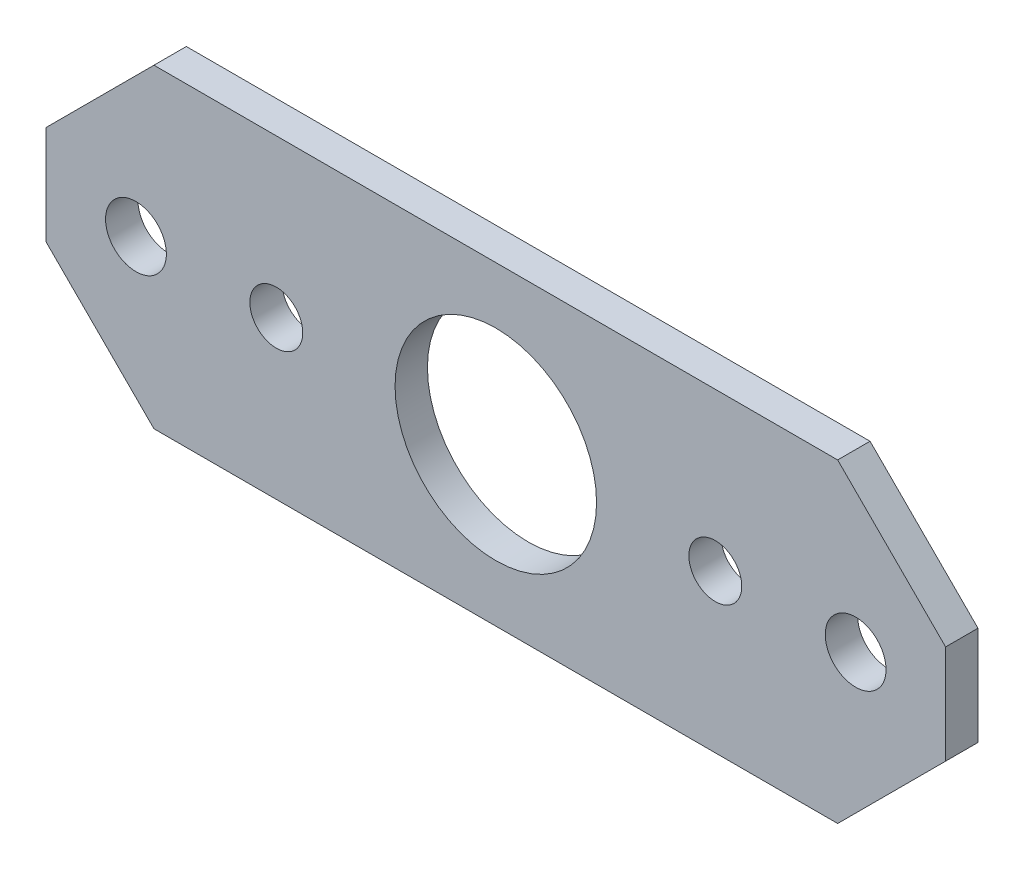
ISO-10303-21;
HEADER;
FILE_DESCRIPTION(('STEP AP214'),'2;1');
FILE_NAME('part.step','',(''),(''),'','','');
FILE_SCHEMA(('AUTOMOTIVE_DESIGN { 1 0 10303 214 1 1 1 1 }'));
ENDSEC;
DATA;
#1=APPLICATION_CONTEXT('core data for automotive mechanical design processes');
#2=APPLICATION_PROTOCOL_DEFINITION('international standard','automotive_design',2000,#1);
#3=PRODUCT_CONTEXT('',#1,'mechanical');
#4=PRODUCT('Part','Part','',(#3));
#5=PRODUCT_RELATED_PRODUCT_CATEGORY('part','',(#4));
#6=PRODUCT_DEFINITION_FORMATION('','',#4);
#7=PRODUCT_DEFINITION_CONTEXT('part definition',#1,'design');
#8=PRODUCT_DEFINITION('design','',#6,#7);
#9=PRODUCT_DEFINITION_SHAPE('','',#8);
#10=(LENGTH_UNIT() NAMED_UNIT(*) SI_UNIT(.MILLI.,.METRE.));
#11=(NAMED_UNIT(*) PLANE_ANGLE_UNIT() SI_UNIT($,.RADIAN.));
#12=(NAMED_UNIT(*) SI_UNIT($,.STERADIAN.) SOLID_ANGLE_UNIT());
#13=UNCERTAINTY_MEASURE_WITH_UNIT(LENGTH_MEASURE(1.E-05),#10,'distance_accuracy_value','');
#14=(GEOMETRIC_REPRESENTATION_CONTEXT(3) GLOBAL_UNCERTAINTY_ASSIGNED_CONTEXT((#13)) GLOBAL_UNIT_ASSIGNED_CONTEXT((#10,
#11,#12)) REPRESENTATION_CONTEXT('',''));
#15=CARTESIAN_POINT('',(0.,0.,0.));
#16=DIRECTION('',(0.,0.,1.));
#17=DIRECTION('',(1.,0.,0.));
#18=AXIS2_PLACEMENT_3D('',#15,#16,#17);
#19=CARTESIAN_POINT('',(-31.75,-11.1125,2.286));
#20=DIRECTION('',(0.,0.,1.));
#21=DIRECTION('',(1.,0.,0.));
#22=AXIS2_PLACEMENT_3D('',#19,#20,#21);
#23=PLANE('',#22);
#24=CARTESIAN_POINT('',(0.,0.,2.286));
#25=DIRECTION('',(0.,0.,-1.));
#26=DIRECTION('',(-1.,0.,0.));
#27=AXIS2_PLACEMENT_3D('',#24,#25,#26);
#28=CIRCLE('',#27,7.112);
#29=CARTESIAN_POINT('',(-7.112,0.,2.286));
#30=VERTEX_POINT('',#29);
#31=EDGE_CURVE('E116',#30,#30,#28,.T.);
#32=ORIENTED_EDGE('',*,*,#31,.T.);
#33=EDGE_LOOP('',(#32));
#34=FACE_BOUND('',#33,.T.);
#35=CARTESIAN_POINT('',(25.4,0.,2.286));
#36=DIRECTION('',(0.,0.,-1.));
#37=DIRECTION('',(-1.,0.,0.));
#38=AXIS2_PLACEMENT_3D('',#35,#36,#37);
#39=CIRCLE('',#38,2.1463);
#40=CARTESIAN_POINT('',(23.2537,0.,2.286));
#41=VERTEX_POINT('',#40);
#42=EDGE_CURVE('E119',#41,#41,#39,.T.);
#43=ORIENTED_EDGE('',*,*,#42,.T.);
#44=EDGE_LOOP('',(#43));
#45=FACE_BOUND('',#44,.T.);
#46=CARTESIAN_POINT('',(-25.4,0.,2.286));
#47=DIRECTION('',(0.,0.,-1.));
#48=DIRECTION('',(-1.,0.,0.));
#49=AXIS2_PLACEMENT_3D('',#46,#47,#48);
#50=CIRCLE('',#49,2.1463);
#51=CARTESIAN_POINT('',(-27.5463,0.,2.286));
#52=VERTEX_POINT('',#51);
#53=EDGE_CURVE('E122',#52,#52,#50,.T.);
#54=ORIENTED_EDGE('',*,*,#53,.T.);
#55=EDGE_LOOP('',(#54));
#56=FACE_BOUND('',#55,.T.);
#57=CARTESIAN_POINT('',(15.494,0.,2.286));
#58=DIRECTION('',(0.,0.,-1.));
#59=DIRECTION('',(-1.,0.,0.));
#60=AXIS2_PLACEMENT_3D('',#57,#58,#59);
#61=CIRCLE('',#60,1.8669);
#62=CARTESIAN_POINT('',(13.6271,0.,2.286));
#63=VERTEX_POINT('',#62);
#64=EDGE_CURVE('E124',#63,#63,#61,.T.);
#65=ORIENTED_EDGE('',*,*,#64,.T.);
#66=EDGE_LOOP('',(#65));
#67=FACE_BOUND('',#66,.T.);
#68=CARTESIAN_POINT('',(-15.494,0.,2.286));
#69=DIRECTION('',(0.,0.,-1.));
#70=DIRECTION('',(-1.,0.,0.));
#71=AXIS2_PLACEMENT_3D('',#68,#69,#70);
#72=CIRCLE('',#71,1.8669);
#73=CARTESIAN_POINT('',(-17.3609,0.,2.286));
#74=VERTEX_POINT('',#73);
#75=EDGE_CURVE('E20',#74,#74,#72,.T.);
#76=ORIENTED_EDGE('',*,*,#75,.T.);
#77=EDGE_LOOP('',(#76));
#78=FACE_BOUND('',#77,.T.);
#79=DIRECTION('',(1.,0.,0.));
#80=VECTOR('',#79,1.);
#81=CARTESIAN_POINT('',(-31.75,11.1125,2.286));
#82=LINE('',#81,#80);
#83=CARTESIAN_POINT('',(24.1300000006,11.1124999998,2.286));
#84=VERTEX_POINT('',#83);
#85=CARTESIAN_POINT('',(-24.1300000007,11.1124999999,2.286));
#86=VERTEX_POINT('',#85);
#87=EDGE_CURVE('E153',#84,#86,#82,.F.);
#88=ORIENTED_EDGE('',*,*,#87,.T.);
#89=DIRECTION('',(0.707106781186548,0.707106781186548,0.));
#90=VECTOR('',#89,1.);
#91=CARTESIAN_POINT('',(-31.75,3.4925,2.286));
#92=LINE('',#91,#90);
#93=CARTESIAN_POINT('',(-31.749999999795,3.492500000615,2.286));
#94=VERTEX_POINT('',#93);
#95=EDGE_CURVE('E148',#86,#94,#92,.F.);
#96=ORIENTED_EDGE('',*,*,#95,.T.);
#97=DIRECTION('',(0.,1.,0.));
#98=VECTOR('',#97,1.);
#99=CARTESIAN_POINT('',(-31.75,11.1125,2.286));
#100=LINE('',#99,#98);
#101=CARTESIAN_POINT('',(-31.7499999999438,-3.49250000039375,2.286));
#102=VERTEX_POINT('',#101);
#103=EDGE_CURVE('E143',#94,#102,#100,.F.);
#104=ORIENTED_EDGE('',*,*,#103,.T.);
#105=DIRECTION('',(-0.707106781186548,0.707106781186548,0.));
#106=VECTOR('',#105,1.);
#107=CARTESIAN_POINT('',(-24.13,-11.1125,2.286));
#108=LINE('',#107,#106);
#109=CARTESIAN_POINT('',(-24.1300000006,-11.1124999998,2.286));
#110=VERTEX_POINT('',#109);
#111=EDGE_CURVE('E138',#102,#110,#108,.F.);
#112=ORIENTED_EDGE('',*,*,#111,.T.);
#113=DIRECTION('',(1.,0.,0.));
#114=VECTOR('',#113,1.);
#115=CARTESIAN_POINT('',(-31.75,-11.1125,2.286));
#116=LINE('',#115,#114);
#117=CARTESIAN_POINT('',(24.1300000006,-11.1124999998,2.286));
#118=VERTEX_POINT('',#117);
#119=EDGE_CURVE('E84',#110,#118,#116,.T.);
#120=ORIENTED_EDGE('',*,*,#119,.T.);
#121=DIRECTION('',(-0.707106781186548,-0.707106781186548,0.));
#122=VECTOR('',#121,1.);
#123=CARTESIAN_POINT('',(31.75,-3.4925,2.286));
#124=LINE('',#123,#122);
#125=CARTESIAN_POINT('',(31.7499999998875,-3.4925000003375,2.286));
#126=VERTEX_POINT('',#125);
#127=EDGE_CURVE('E83',#118,#126,#124,.F.);
#128=ORIENTED_EDGE('',*,*,#127,.T.);
#129=DIRECTION('',(0.,1.,0.));
#130=VECTOR('',#129,1.);
#131=CARTESIAN_POINT('',(31.75,11.1125,2.286));
#132=LINE('',#131,#130);
#133=CARTESIAN_POINT('',(31.7499999998975,3.4925000007175,2.286));
#134=VERTEX_POINT('',#133);
#135=EDGE_CURVE('E80',#126,#134,#132,.T.);
#136=ORIENTED_EDGE('',*,*,#135,.T.);
#137=DIRECTION('',(0.707106781186548,-0.707106781186548,0.));
#138=VECTOR('',#137,1.);
#139=CARTESIAN_POINT('',(24.13,11.1125,2.286));
#140=LINE('',#139,#138);
#141=EDGE_CURVE('E158',#134,#84,#140,.F.);
#142=ORIENTED_EDGE('',*,*,#141,.T.);
#143=EDGE_LOOP('',(#88,#96,#104,#112,#120,#128,#136,#142));
#144=FACE_BOUND('',#143,.T.);
#145=ADVANCED_FACE('F17',(#34,#45,#56,#67,#78,#144),#23,.T.);
#146=CARTESIAN_POINT('',(31.75,-3.4925,2.286));
#147=DIRECTION('',(-0.707106781186548,0.707106781186548,0.));
#148=DIRECTION('',(-0.707106781186548,-0.707106781186548,0.));
#149=AXIS2_PLACEMENT_3D('',#146,#147,#148);
#150=PLANE('',#149);
#151=DIRECTION('',(0.,0.,1.));
#152=VECTOR('',#151,1.);
#153=CARTESIAN_POINT('',(24.1300000008,-11.1125,2.286));
#154=LINE('',#153,#152);
#155=CARTESIAN_POINT('',(24.1300000006,-11.1124999998,-2.34694100091637E-10));
#156=VERTEX_POINT('',#155);
#157=EDGE_CURVE('E132',#118,#156,#154,.F.);
#158=ORIENTED_EDGE('',*,*,#157,.T.);
#159=DIRECTION('',(0.707106781170308,0.707106781202787,0.));
#160=VECTOR('',#159,1.);
#161=CARTESIAN_POINT('',(24.1300000008,-11.1125,0.));
#162=LINE('',#161,#160);
#163=CARTESIAN_POINT('',(31.7499999998875,-3.4925000003375,-2.34693883251202E-10));
#164=VERTEX_POINT('',#163);
#165=EDGE_CURVE('E100',#156,#164,#162,.T.);
#166=ORIENTED_EDGE('',*,*,#165,.T.);
#167=DIRECTION('',(0.,0.,1.));
#168=VECTOR('',#167,1.);
#169=CARTESIAN_POINT('',(31.75,-3.49250000045,2.286));
#170=LINE('',#169,#168);
#171=EDGE_CURVE('E89',#164,#126,#170,.T.);
#172=ORIENTED_EDGE('',*,*,#171,.T.);
#173=ORIENTED_EDGE('',*,*,#127,.F.);
#174=EDGE_LOOP('',(#158,#166,#172,#173));
#175=FACE_BOUND('',#174,.T.);
#176=ADVANCED_FACE('F99',(#175),#150,.F.);
#177=CARTESIAN_POINT('',(31.75,11.1125,2.286));
#178=DIRECTION('',(-1.,0.,0.));
#179=DIRECTION('',(0.,0.,1.));
#180=AXIS2_PLACEMENT_3D('',#177,#178,#179);
#181=PLANE('',#180);
#182=ORIENTED_EDGE('',*,*,#171,.F.);
#183=DIRECTION('',(0.,1.,0.));
#184=VECTOR('',#183,1.);
#185=CARTESIAN_POINT('',(31.75,-11.1125,0.));
#186=LINE('',#185,#184);
#187=CARTESIAN_POINT('',(31.7499999998975,3.4925000007175,-2.34693774830985E-10));
#188=VERTEX_POINT('',#187);
#189=EDGE_CURVE('E172',#164,#188,#186,.T.);
#190=ORIENTED_EDGE('',*,*,#189,.T.);
#191=DIRECTION('',(0.,0.,1.));
#192=VECTOR('',#191,1.);
#193=CARTESIAN_POINT('',(31.74999999959,3.49250000041,2.286));
#194=LINE('',#193,#192);
#195=EDGE_CURVE('E96',#188,#134,#194,.T.);
#196=ORIENTED_EDGE('',*,*,#195,.T.);
#197=ORIENTED_EDGE('',*,*,#135,.F.);
#198=EDGE_LOOP('',(#182,#190,#196,#197));
#199=FACE_BOUND('',#198,.T.);
#200=ADVANCED_FACE('F93',(#199),#181,.F.);
#201=CARTESIAN_POINT('',(24.13,11.1125,2.286));
#202=DIRECTION('',(-0.707106781186548,-0.707106781186548,0.));
#203=DIRECTION('',(0.707106781186548,-0.707106781186548,0.));
#204=AXIS2_PLACEMENT_3D('',#201,#202,#203);
#205=PLANE('',#204);
#206=ORIENTED_EDGE('',*,*,#195,.F.);
#207=DIRECTION('',(-0.707106781187475,0.707106781185619,0.));
#208=VECTOR('',#207,1.);
#209=CARTESIAN_POINT('',(31.75,3.49250000082,0.));
#210=LINE('',#209,#208);
#211=CARTESIAN_POINT('',(24.1300000006,11.1124999998,-2.34693883251202E-10));
#212=VERTEX_POINT('',#211);
#213=EDGE_CURVE('E169',#188,#212,#210,.T.);
#214=ORIENTED_EDGE('',*,*,#213,.T.);
#215=DIRECTION('',(0.,0.,-1.));
#216=VECTOR('',#215,1.);
#217=CARTESIAN_POINT('',(24.1300000008,11.1125,2.286));
#218=LINE('',#217,#216);
#219=EDGE_CURVE('E155',#212,#84,#218,.F.);
#220=ORIENTED_EDGE('',*,*,#219,.T.);
#221=ORIENTED_EDGE('',*,*,#141,.F.);
#222=EDGE_LOOP('',(#206,#214,#220,#221));
#223=FACE_BOUND('',#222,.T.);
#224=ADVANCED_FACE('F167',(#223),#205,.F.);
#225=CARTESIAN_POINT('',(-31.75,11.1125,2.286));
#226=DIRECTION('',(0.,-1.,0.));
#227=DIRECTION('',(0.,0.,-1.));
#228=AXIS2_PLACEMENT_3D('',#225,#226,#227);
#229=PLANE('',#228);
#230=ORIENTED_EDGE('',*,*,#219,.F.);
#231=DIRECTION('',(1.,0.,0.));
#232=VECTOR('',#231,1.);
#233=CARTESIAN_POINT('',(-31.75,11.1125,0.));
#234=LINE('',#233,#232);
#235=CARTESIAN_POINT('',(-24.1300000007,11.1124999999,-2.34693774830985E-10));
#236=VERTEX_POINT('',#235);
#237=EDGE_CURVE('E171',#212,#236,#234,.F.);
#238=ORIENTED_EDGE('',*,*,#237,.T.);
#239=DIRECTION('',(0.,0.,1.));
#240=VECTOR('',#239,1.);
#241=CARTESIAN_POINT('',(-24.1300000004,11.1124999996,2.286));
#242=LINE('',#241,#240);
#243=EDGE_CURVE('E150',#236,#86,#242,.T.);
#244=ORIENTED_EDGE('',*,*,#243,.T.);
#245=ORIENTED_EDGE('',*,*,#87,.F.);
#246=EDGE_LOOP('',(#230,#238,#244,#245));
#247=FACE_BOUND('',#246,.T.);
#248=ADVANCED_FACE('F163',(#247),#229,.F.);
#249=CARTESIAN_POINT('',(-31.75,3.4925,2.286));
#250=DIRECTION('',(0.707106781186548,-0.707106781186548,0.));
#251=DIRECTION('',(0.707106781186548,0.707106781186548,0.));
#252=AXIS2_PLACEMENT_3D('',#249,#250,#251);
#253=PLANE('',#252);
#254=ORIENTED_EDGE('',*,*,#243,.F.);
#255=DIRECTION('',(-0.707106781187475,-0.70710678118562,0.));
#256=VECTOR('',#255,1.);
#257=CARTESIAN_POINT('',(-24.1300000008,11.1125,0.));
#258=LINE('',#257,#256);
#259=CARTESIAN_POINT('',(-31.749999999795,3.492500000615,-2.34693883251202E-10));
#260=VERTEX_POINT('',#259);
#261=EDGE_CURVE('E174',#236,#260,#258,.T.);
#262=ORIENTED_EDGE('',*,*,#261,.T.);
#263=DIRECTION('',(0.,0.,-1.));
#264=VECTOR('',#263,1.);
#265=CARTESIAN_POINT('',(-31.75,3.49250000082,2.286));
#266=LINE('',#265,#264);
#267=EDGE_CURVE('E145',#260,#94,#266,.F.);
#268=ORIENTED_EDGE('',*,*,#267,.T.);
#269=ORIENTED_EDGE('',*,*,#95,.F.);
#270=EDGE_LOOP('',(#254,#262,#268,#269));
#271=FACE_BOUND('',#270,.T.);
#272=ADVANCED_FACE('F197',(#271),#253,.F.);
#273=CARTESIAN_POINT('',(-31.75,11.1125,2.286));
#274=DIRECTION('',(1.,0.,0.));
#275=DIRECTION('',(0.,0.,-1.));
#276=AXIS2_PLACEMENT_3D('',#273,#274,#275);
#277=PLANE('',#276);
#278=DIRECTION('',(0.,0.,1.));
#279=VECTOR('',#278,1.);
#280=CARTESIAN_POINT('',(-31.749999999775,-3.492500000225,2.286));
#281=LINE('',#280,#279);
#282=CARTESIAN_POINT('',(-31.7499999999438,-3.49250000039375,-2.34693774830985E-10));
#283=VERTEX_POINT('',#282);
#284=EDGE_CURVE('E140',#283,#102,#281,.T.);
#285=ORIENTED_EDGE('',*,*,#284,.T.);
#286=ORIENTED_EDGE('',*,*,#103,.F.);
#287=ORIENTED_EDGE('',*,*,#267,.F.);
#288=DIRECTION('',(0.,1.,0.));
#289=VECTOR('',#288,1.);
#290=CARTESIAN_POINT('',(-31.75,-11.1125,0.));
#291=LINE('',#290,#289);
#292=EDGE_CURVE('E179',#260,#283,#291,.F.);
#293=ORIENTED_EDGE('',*,*,#292,.T.);
#294=EDGE_LOOP('',(#285,#286,#287,#293));
#295=FACE_BOUND('',#294,.T.);
#296=ADVANCED_FACE('F194',(#295),#277,.F.);
#297=CARTESIAN_POINT('',(-24.13,-11.1125,2.286));
#298=DIRECTION('',(0.707106781186548,0.707106781186548,0.));
#299=DIRECTION('',(-0.707106781186548,0.707106781186548,0.));
#300=AXIS2_PLACEMENT_3D('',#297,#298,#299);
#301=PLANE('',#300);
#302=ORIENTED_EDGE('',*,*,#284,.F.);
#303=DIRECTION('',(0.707106781170308,-0.707106781202787,0.));
#304=VECTOR('',#303,1.);
#305=CARTESIAN_POINT('',(-31.75,-3.49250000045,0.));
#306=LINE('',#305,#304);
#307=CARTESIAN_POINT('',(-24.1300000006,-11.1124999998,-2.34693883251202E-10));
#308=VERTEX_POINT('',#307);
#309=EDGE_CURVE('E182',#283,#308,#306,.T.);
#310=ORIENTED_EDGE('',*,*,#309,.T.);
#311=DIRECTION('',(0.,0.,1.));
#312=VECTOR('',#311,1.);
#313=CARTESIAN_POINT('',(-24.1300000008,-11.1125,2.286));
#314=LINE('',#313,#312);
#315=EDGE_CURVE('E35',#308,#110,#314,.T.);
#316=ORIENTED_EDGE('',*,*,#315,.T.);
#317=ORIENTED_EDGE('',*,*,#111,.F.);
#318=EDGE_LOOP('',(#302,#310,#316,#317));
#319=FACE_BOUND('',#318,.T.);
#320=ADVANCED_FACE('F190',(#319),#301,.F.);
#321=CARTESIAN_POINT('',(-31.75,-11.1125,2.286));
#322=DIRECTION('',(0.,1.,0.));
#323=DIRECTION('',(0.,0.,1.));
#324=AXIS2_PLACEMENT_3D('',#321,#322,#323);
#325=PLANE('',#324);
#326=ORIENTED_EDGE('',*,*,#315,.F.);
#327=DIRECTION('',(1.,0.,0.));
#328=VECTOR('',#327,1.);
#329=CARTESIAN_POINT('',(-31.75,-11.1125,0.));
#330=LINE('',#329,#328);
#331=EDGE_CURVE('E115',#308,#156,#330,.T.);
#332=ORIENTED_EDGE('',*,*,#331,.T.);
#333=ORIENTED_EDGE('',*,*,#157,.F.);
#334=ORIENTED_EDGE('',*,*,#119,.F.);
#335=EDGE_LOOP('',(#326,#332,#333,#334));
#336=FACE_BOUND('',#335,.T.);
#337=ADVANCED_FACE('F185',(#336),#325,.F.);
#338=CARTESIAN_POINT('',(-15.494,0.,2.286));
#339=DIRECTION('',(0.,0.,-1.));
#340=DIRECTION('',(-1.,0.,0.));
#341=AXIS2_PLACEMENT_3D('',#338,#339,#340);
#342=CYLINDRICAL_SURFACE('',#341,1.8669);
#343=ORIENTED_EDGE('',*,*,#75,.F.);
#344=EDGE_LOOP('',(#343));
#345=FACE_BOUND('',#344,.T.);
#346=CARTESIAN_POINT('',(-15.494,0.,-3.12924599427111E-10));
#347=DIRECTION('',(0.,0.,-1.));
#348=DIRECTION('',(-1.,0.,0.));
#349=AXIS2_PLACEMENT_3D('',#346,#347,#348);
#350=CIRCLE('',#349,1.8669);
#351=CARTESIAN_POINT('',(-17.3609,0.,-3.12924599427111E-10));
#352=VERTEX_POINT('',#351);
#353=EDGE_CURVE('E112',#352,#352,#350,.T.);
#354=ORIENTED_EDGE('',*,*,#353,.T.);
#355=EDGE_LOOP('',(#354));
#356=FACE_BOUND('',#355,.T.);
#357=ADVANCED_FACE('F230',(#345,#356),#342,.F.);
#358=CARTESIAN_POINT('',(15.494,0.,2.286));
#359=DIRECTION('',(0.,0.,-1.));
#360=DIRECTION('',(-1.,0.,0.));
#361=AXIS2_PLACEMENT_3D('',#358,#359,#360);
#362=CYLINDRICAL_SURFACE('',#361,1.8669);
#363=ORIENTED_EDGE('',*,*,#64,.F.);
#364=EDGE_LOOP('',(#363));
#365=FACE_BOUND('',#364,.T.);
#366=CARTESIAN_POINT('',(15.494,0.,-3.12924599427111E-10));
#367=DIRECTION('',(0.,0.,-1.));
#368=DIRECTION('',(-1.,0.,0.));
#369=AXIS2_PLACEMENT_3D('',#366,#367,#368);
#370=CIRCLE('',#369,1.8669);
#371=CARTESIAN_POINT('',(13.6271,0.,-3.12924599427111E-10));
#372=VERTEX_POINT('',#371);
#373=EDGE_CURVE('E109',#372,#372,#370,.T.);
#374=ORIENTED_EDGE('',*,*,#373,.T.);
#375=EDGE_LOOP('',(#374));
#376=FACE_BOUND('',#375,.T.);
#377=ADVANCED_FACE('F226',(#365,#376),#362,.F.);
#378=CARTESIAN_POINT('',(-25.4,0.,2.286));
#379=DIRECTION('',(0.,0.,-1.));
#380=DIRECTION('',(-1.,0.,0.));
#381=AXIS2_PLACEMENT_3D('',#378,#379,#380);
#382=CYLINDRICAL_SURFACE('',#381,2.1463);
#383=ORIENTED_EDGE('',*,*,#53,.F.);
#384=EDGE_LOOP('',(#383));
#385=FACE_BOUND('',#384,.T.);
#386=CARTESIAN_POINT('',(-25.4,0.,-3.12924599427111E-10));
#387=DIRECTION('',(0.,0.,-1.));
#388=DIRECTION('',(-1.,0.,0.));
#389=AXIS2_PLACEMENT_3D('',#386,#387,#388);
#390=CIRCLE('',#389,2.1463);
#391=CARTESIAN_POINT('',(-27.5463,0.,-3.12924599427111E-10));
#392=VERTEX_POINT('',#391);
#393=EDGE_CURVE('E106',#392,#392,#390,.T.);
#394=ORIENTED_EDGE('',*,*,#393,.T.);
#395=EDGE_LOOP('',(#394));
#396=FACE_BOUND('',#395,.T.);
#397=ADVANCED_FACE('F222',(#385,#396),#382,.F.);
#398=CARTESIAN_POINT('',(25.4,0.,2.286));
#399=DIRECTION('',(0.,0.,-1.));
#400=DIRECTION('',(-1.,0.,0.));
#401=AXIS2_PLACEMENT_3D('',#398,#399,#400);
#402=CYLINDRICAL_SURFACE('',#401,2.1463);
#403=ORIENTED_EDGE('',*,*,#42,.F.);
#404=EDGE_LOOP('',(#403));
#405=FACE_BOUND('',#404,.T.);
#406=CARTESIAN_POINT('',(25.4,0.,-3.12924599427111E-10));
#407=DIRECTION('',(0.,0.,-1.));
#408=DIRECTION('',(-1.,0.,0.));
#409=AXIS2_PLACEMENT_3D('',#406,#407,#408);
#410=CIRCLE('',#409,2.1463);
#411=CARTESIAN_POINT('',(23.2537,0.,-3.12924599427111E-10));
#412=VERTEX_POINT('',#411);
#413=EDGE_CURVE('E26',#412,#412,#410,.T.);
#414=ORIENTED_EDGE('',*,*,#413,.T.);
#415=EDGE_LOOP('',(#414));
#416=FACE_BOUND('',#415,.T.);
#417=ADVANCED_FACE('F214',(#405,#416),#402,.F.);
#418=CARTESIAN_POINT('',(0.,0.,2.286));
#419=DIRECTION('',(0.,0.,-1.));
#420=DIRECTION('',(-1.,0.,0.));
#421=AXIS2_PLACEMENT_3D('',#418,#419,#420);
#422=CYLINDRICAL_SURFACE('',#421,7.112);
#423=ORIENTED_EDGE('',*,*,#31,.F.);
#424=EDGE_LOOP('',(#423));
#425=FACE_BOUND('',#424,.T.);
#426=CARTESIAN_POINT('',(0.,0.,-3.12924599427111E-10));
#427=DIRECTION('',(0.,0.,-1.));
#428=DIRECTION('',(-1.,0.,0.));
#429=AXIS2_PLACEMENT_3D('',#426,#427,#428);
#430=CIRCLE('',#429,7.112);
#431=CARTESIAN_POINT('',(-7.112,0.,-3.12924599427111E-10));
#432=VERTEX_POINT('',#431);
#433=EDGE_CURVE('E11',#432,#432,#430,.T.);
#434=ORIENTED_EDGE('',*,*,#433,.T.);
#435=EDGE_LOOP('',(#434));
#436=FACE_BOUND('',#435,.T.);
#437=ADVANCED_FACE('F208',(#425,#436),#422,.F.);
#438=CARTESIAN_POINT('',(-31.75,-11.1125,0.));
#439=DIRECTION('',(0.,0.,1.));
#440=DIRECTION('',(1.,0.,0.));
#441=AXIS2_PLACEMENT_3D('',#438,#439,#440);
#442=PLANE('',#441);
#443=ORIENTED_EDGE('',*,*,#433,.F.);
#444=EDGE_LOOP('',(#443));
#445=FACE_BOUND('',#444,.T.);
#446=ORIENTED_EDGE('',*,*,#413,.F.);
#447=EDGE_LOOP('',(#446));
#448=FACE_BOUND('',#447,.T.);
#449=ORIENTED_EDGE('',*,*,#393,.F.);
#450=EDGE_LOOP('',(#449));
#451=FACE_BOUND('',#450,.T.);
#452=ORIENTED_EDGE('',*,*,#373,.F.);
#453=EDGE_LOOP('',(#452));
#454=FACE_BOUND('',#453,.T.);
#455=ORIENTED_EDGE('',*,*,#353,.F.);
#456=EDGE_LOOP('',(#455));
#457=FACE_BOUND('',#456,.T.);
#458=ORIENTED_EDGE('',*,*,#309,.F.);
#459=ORIENTED_EDGE('',*,*,#292,.F.);
#460=ORIENTED_EDGE('',*,*,#261,.F.);
#461=ORIENTED_EDGE('',*,*,#237,.F.);
#462=ORIENTED_EDGE('',*,*,#213,.F.);
#463=ORIENTED_EDGE('',*,*,#189,.F.);
#464=ORIENTED_EDGE('',*,*,#165,.F.);
#465=ORIENTED_EDGE('',*,*,#331,.F.);
#466=EDGE_LOOP('',(#458,#459,#460,#461,#462,#463,#464,#465));
#467=FACE_BOUND('',#466,.T.);
#468=ADVANCED_FACE('F187',(#445,#448,#451,#454,#457,#467),#442,.F.);
#469=CLOSED_SHELL('',(#145,#176,#200,#224,#248,#272,#296,#320,#337,#357,#377,#397,#417,#437,#468));
#470=MANIFOLD_SOLID_BREP('B1',#469);
#471=ADVANCED_BREP_SHAPE_REPRESENTATION('',(#18,#470),#14);
#472=SHAPE_DEFINITION_REPRESENTATION(#9,#471);
ENDSEC;
END-ISO-10303-21;
